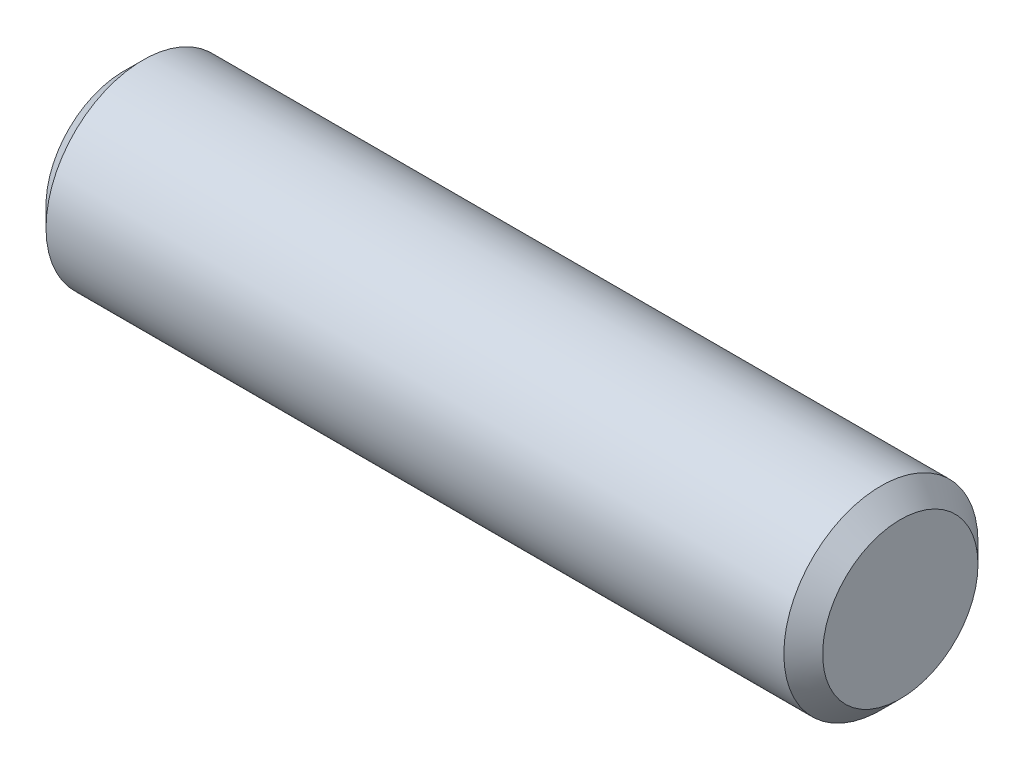
ISO-10303-21;
HEADER;
FILE_DESCRIPTION(('STEP AP214'),'2;1');
FILE_NAME('part.step','',(''),(''),'','','');
FILE_SCHEMA(('AUTOMOTIVE_DESIGN { 1 0 10303 214 1 1 1 1 }'));
ENDSEC;
DATA;
#1=APPLICATION_CONTEXT('core data for automotive mechanical design processes');
#2=APPLICATION_PROTOCOL_DEFINITION('international standard','automotive_design',2000,#1);
#3=PRODUCT_CONTEXT('',#1,'mechanical');
#4=PRODUCT('Part','Part','',(#3));
#5=PRODUCT_RELATED_PRODUCT_CATEGORY('part','',(#4));
#6=PRODUCT_DEFINITION_FORMATION('','',#4);
#7=PRODUCT_DEFINITION_CONTEXT('part definition',#1,'design');
#8=PRODUCT_DEFINITION('design','',#6,#7);
#9=PRODUCT_DEFINITION_SHAPE('','',#8);
#10=(LENGTH_UNIT() NAMED_UNIT(*) SI_UNIT(.MILLI.,.METRE.));
#11=(NAMED_UNIT(*) PLANE_ANGLE_UNIT() SI_UNIT($,.RADIAN.));
#12=(NAMED_UNIT(*) SI_UNIT($,.STERADIAN.) SOLID_ANGLE_UNIT());
#13=UNCERTAINTY_MEASURE_WITH_UNIT(LENGTH_MEASURE(1.E-05),#10,'distance_accuracy_value','');
#14=(GEOMETRIC_REPRESENTATION_CONTEXT(3) GLOBAL_UNCERTAINTY_ASSIGNED_CONTEXT((#13)) GLOBAL_UNIT_ASSIGNED_CONTEXT((#10,
#11,#12)) REPRESENTATION_CONTEXT('',''));
#15=CARTESIAN_POINT('',(0.,0.,0.));
#16=DIRECTION('',(0.,0.,1.));
#17=DIRECTION('',(1.,0.,0.));
#18=AXIS2_PLACEMENT_3D('',#15,#16,#17);
#19=CARTESIAN_POINT('',(-3.175,0.,0.));
#20=DIRECTION('',(1.,0.,0.));
#21=DIRECTION('',(0.,0.,-1.));
#22=AXIS2_PLACEMENT_3D('',#19,#20,#21);
#23=CYLINDRICAL_SURFACE('',#22,0.79375);
#24=CARTESIAN_POINT('',(3.01625,0.,0.));
#25=DIRECTION('',(1.,0.,0.));
#26=DIRECTION('',(0.,0.,-1.));
#27=AXIS2_PLACEMENT_3D('',#24,#25,#26);
#28=CIRCLE('',#27,0.79375);
#29=CARTESIAN_POINT('',(3.01625,0.,-0.79375));
#30=VERTEX_POINT('',#29);
#31=EDGE_CURVE('E39',#30,#30,#28,.F.);
#32=ORIENTED_EDGE('',*,*,#31,.T.);
#33=EDGE_LOOP('',(#32));
#34=FACE_BOUND('',#33,.T.);
#35=CARTESIAN_POINT('',(-3.01625,0.,0.));
#36=DIRECTION('',(1.,0.,0.));
#37=DIRECTION('',(0.,0.,-1.));
#38=AXIS2_PLACEMENT_3D('',#35,#36,#37);
#39=CIRCLE('',#38,0.79375);
#40=CARTESIAN_POINT('',(-3.01625,0.,-0.79375));
#41=VERTEX_POINT('',#40);
#42=EDGE_CURVE('E43',#41,#41,#39,.T.);
#43=ORIENTED_EDGE('',*,*,#42,.T.);
#44=EDGE_LOOP('',(#43));
#45=FACE_BOUND('',#44,.T.);
#46=ADVANCED_FACE('F32',(#34,#45),#23,.T.);
#47=CARTESIAN_POINT('',(-3.175,0.,0.));
#48=DIRECTION('',(1.,0.,0.));
#49=DIRECTION('',(0.,0.,-1.));
#50=AXIS2_PLACEMENT_3D('',#47,#48,#49);
#51=PLANE('',#50);
#52=CARTESIAN_POINT('',(-3.175,0.,0.));
#53=DIRECTION('',(1.,0.,0.));
#54=DIRECTION('',(0.,0.,-1.));
#55=AXIS2_PLACEMENT_3D('',#52,#53,#54);
#56=CIRCLE('',#55,0.635);
#57=CARTESIAN_POINT('',(-3.175,0.,-0.635));
#58=VERTEX_POINT('',#57);
#59=EDGE_CURVE('E10',#58,#58,#56,.F.);
#60=ORIENTED_EDGE('',*,*,#59,.T.);
#61=EDGE_LOOP('',(#60));
#62=FACE_BOUND('',#61,.T.);
#63=ADVANCED_FACE('F63',(#62),#51,.F.);
#64=CARTESIAN_POINT('',(3.175,0.,0.));
#65=DIRECTION('',(1.,0.,0.));
#66=DIRECTION('',(0.,0.,-1.));
#67=AXIS2_PLACEMENT_3D('',#64,#65,#66);
#68=PLANE('',#67);
#69=CARTESIAN_POINT('',(3.175,0.,0.));
#70=DIRECTION('',(1.,0.,0.));
#71=DIRECTION('',(0.,0.,-1.));
#72=AXIS2_PLACEMENT_3D('',#69,#70,#71);
#73=CIRCLE('',#72,0.635);
#74=CARTESIAN_POINT('',(3.175,0.,-0.635));
#75=VERTEX_POINT('',#74);
#76=EDGE_CURVE('E47',#75,#75,#73,.T.);
#77=ORIENTED_EDGE('',*,*,#76,.T.);
#78=EDGE_LOOP('',(#77));
#79=FACE_BOUND('',#78,.T.);
#80=ADVANCED_FACE('F53',(#79),#68,.T.);
#81=CARTESIAN_POINT('',(3.175,0.,0.));
#82=DIRECTION('',(-1.,0.,0.));
#83=DIRECTION('',(0.,0.,1.));
#84=AXIS2_PLACEMENT_3D('',#81,#82,#83);
#85=CONICAL_SURFACE('',#84,0.635,0.785398163397445);
#86=ORIENTED_EDGE('',*,*,#31,.F.);
#87=EDGE_LOOP('',(#86));
#88=FACE_BOUND('',#87,.T.);
#89=ORIENTED_EDGE('',*,*,#76,.F.);
#90=EDGE_LOOP('',(#89));
#91=FACE_BOUND('',#90,.T.);
#92=ADVANCED_FACE('F55',(#88,#91),#85,.T.);
#93=CARTESIAN_POINT('',(-3.01625,0.,0.));
#94=DIRECTION('',(1.,0.,0.));
#95=DIRECTION('',(0.,0.,-1.));
#96=AXIS2_PLACEMENT_3D('',#93,#94,#95);
#97=CONICAL_SURFACE('',#96,0.79375,0.785398163397448);
#98=ORIENTED_EDGE('',*,*,#59,.F.);
#99=EDGE_LOOP('',(#98));
#100=FACE_BOUND('',#99,.T.);
#101=ORIENTED_EDGE('',*,*,#42,.F.);
#102=EDGE_LOOP('',(#101));
#103=FACE_BOUND('',#102,.T.);
#104=ADVANCED_FACE('F34',(#100,#103),#97,.T.);
#105=CLOSED_SHELL('',(#46,#63,#80,#92,#104));
#106=MANIFOLD_SOLID_BREP('B2',#105);
#107=ADVANCED_BREP_SHAPE_REPRESENTATION('',(#18,#106),#14);
#108=SHAPE_DEFINITION_REPRESENTATION(#9,#107);
ENDSEC;
END-ISO-10303-21;
